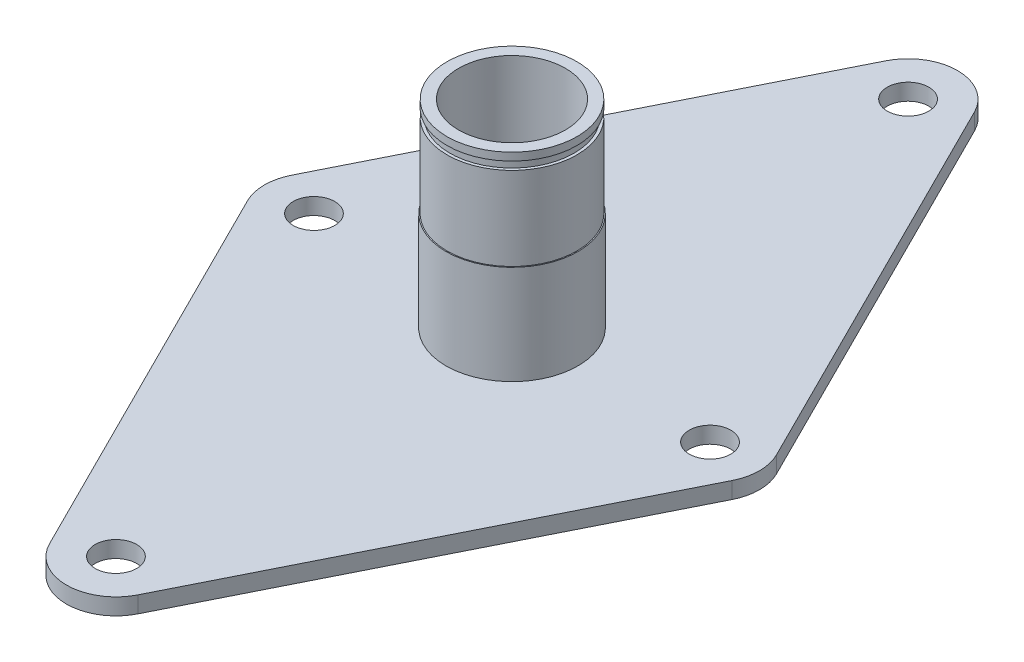
ISO-10303-21;
HEADER;
FILE_DESCRIPTION(('STEP AP214'),'2;1');
FILE_NAME('part.step','',(''),(''),'','','');
FILE_SCHEMA(('AUTOMOTIVE_DESIGN { 1 0 10303 214 1 1 1 1 }'));
ENDSEC;
DATA;
#1=APPLICATION_CONTEXT('core data for automotive mechanical design processes');
#2=APPLICATION_PROTOCOL_DEFINITION('international standard','automotive_design',2000,#1);
#3=PRODUCT_CONTEXT('',#1,'mechanical');
#4=PRODUCT('Part','Part','',(#3));
#5=PRODUCT_RELATED_PRODUCT_CATEGORY('part','',(#4));
#6=PRODUCT_DEFINITION_FORMATION('','',#4);
#7=PRODUCT_DEFINITION_CONTEXT('part definition',#1,'design');
#8=PRODUCT_DEFINITION('design','',#6,#7);
#9=PRODUCT_DEFINITION_SHAPE('','',#8);
#10=(LENGTH_UNIT() NAMED_UNIT(*) SI_UNIT(.MILLI.,.METRE.));
#11=(NAMED_UNIT(*) PLANE_ANGLE_UNIT() SI_UNIT($,.RADIAN.));
#12=(NAMED_UNIT(*) SI_UNIT($,.STERADIAN.) SOLID_ANGLE_UNIT());
#13=UNCERTAINTY_MEASURE_WITH_UNIT(LENGTH_MEASURE(1.E-05),#10,'distance_accuracy_value','');
#14=(GEOMETRIC_REPRESENTATION_CONTEXT(3) GLOBAL_UNCERTAINTY_ASSIGNED_CONTEXT((#13)) GLOBAL_UNIT_ASSIGNED_CONTEXT((#10,
#11,#12)) REPRESENTATION_CONTEXT('',''));
#15=CARTESIAN_POINT('',(0.,0.,0.));
#16=DIRECTION('',(0.,0.,1.));
#17=DIRECTION('',(1.,0.,0.));
#18=AXIS2_PLACEMENT_3D('',#15,#16,#17);
#19=CARTESIAN_POINT('',(0.,38.1,0.));
#20=DIRECTION('',(0.,-1.,0.));
#21=DIRECTION('',(0.,0.,-1.));
#22=AXIS2_PLACEMENT_3D('',#19,#20,#21);
#23=CYLINDRICAL_SURFACE('',#22,12.7);
#24=CARTESIAN_POINT('',(0.,0.,0.));
#25=DIRECTION('',(0.,1.,0.));
#26=DIRECTION('',(0.,0.,1.));
#27=AXIS2_PLACEMENT_3D('',#24,#25,#26);
#28=CIRCLE('',#27,12.7);
#29=CARTESIAN_POINT('',(0.,0.,12.7));
#30=VERTEX_POINT('',#29);
#31=EDGE_CURVE('E287',#30,#30,#28,.T.);
#32=ORIENTED_EDGE('',*,*,#31,.T.);
#33=EDGE_LOOP('',(#32));
#34=FACE_BOUND('',#33,.T.);
#35=CARTESIAN_POINT('',(0.,19.05,0.));
#36=DIRECTION('',(0.,1.,0.));
#37=DIRECTION('',(0.,0.,1.));
#38=AXIS2_PLACEMENT_3D('',#35,#36,#37);
#39=CIRCLE('',#38,12.7);
#40=CARTESIAN_POINT('',(0.,19.05,12.7));
#41=VERTEX_POINT('',#40);
#42=EDGE_CURVE('E281',#41,#41,#39,.T.);
#43=ORIENTED_EDGE('',*,*,#42,.F.);
#44=EDGE_LOOP('',(#43));
#45=FACE_BOUND('',#44,.T.);
#46=ADVANCED_FACE('F38',(#34,#45),#23,.T.);
#47=CARTESIAN_POINT('',(0.,-3.175,-76.2));
#48=DIRECTION('',(0.,1.,0.));
#49=DIRECTION('',(0.,0.,1.));
#50=AXIS2_PLACEMENT_3D('',#47,#48,#49);
#51=CYLINDRICAL_SURFACE('',#50,9.52500000000001);
#52=CARTESIAN_POINT('',(0.,0.,-76.2));
#53=DIRECTION('',(0.,1.,0.));
#54=DIRECTION('',(0.,0.,1.));
#55=AXIS2_PLACEMENT_3D('',#52,#53,#54);
#56=CIRCLE('',#55,9.52500000000001);
#57=CARTESIAN_POINT('',(8.51941899427421,0.,-80.4597094971371));
#58=VERTEX_POINT('',#57);
#59=CARTESIAN_POINT('',(-8.51941899427421,0.,-80.4597094971371));
#60=VERTEX_POINT('',#59);
#61=EDGE_CURVE('E137',#58,#60,#56,.T.);
#62=ORIENTED_EDGE('',*,*,#61,.F.);
#63=DIRECTION('',(0.,1.,0.));
#64=VECTOR('',#63,1.);
#65=CARTESIAN_POINT('',(8.51941899427421,-3.175,-80.4597094971371));
#66=LINE('',#65,#64);
#67=CARTESIAN_POINT('',(8.51941899427421,-3.175,-80.4597094971371));
#68=VERTEX_POINT('',#67);
#69=EDGE_CURVE('E47',#68,#58,#66,.T.);
#70=ORIENTED_EDGE('',*,*,#69,.F.);
#71=CARTESIAN_POINT('',(0.,-3.175,-76.2));
#72=DIRECTION('',(0.,1.,0.));
#73=DIRECTION('',(0.,0.,1.));
#74=AXIS2_PLACEMENT_3D('',#71,#72,#73);
#75=CIRCLE('',#74,9.52500000000001);
#76=CARTESIAN_POINT('',(-8.51941899427421,-3.175,-80.4597094971371));
#77=VERTEX_POINT('',#76);
#78=EDGE_CURVE('E159',#68,#77,#75,.T.);
#79=ORIENTED_EDGE('',*,*,#78,.T.);
#80=DIRECTION('',(0.,1.,0.));
#81=VECTOR('',#80,1.);
#82=CARTESIAN_POINT('',(-8.51941899427421,-3.175,-80.4597094971371));
#83=LINE('',#82,#81);
#84=EDGE_CURVE('E95',#77,#60,#83,.T.);
#85=ORIENTED_EDGE('',*,*,#84,.T.);
#86=EDGE_LOOP('',(#62,#70,#79,#85));
#87=FACE_BOUND('',#86,.T.);
#88=ADVANCED_FACE('F40',(#87),#51,.T.);
#89=CARTESIAN_POINT('',(46.6194189942742,-3.175,-4.2597094971371));
#90=DIRECTION('',(0.894427190999916,0.,-0.447213595499958));
#91=DIRECTION('',(-0.447213595499958,0.,-0.894427190999916));
#92=AXIS2_PLACEMENT_3D('',#89,#90,#91);
#93=PLANE('',#92);
#94=DIRECTION('',(-0.447213595499958,0.,-0.894427190999916));
#95=VECTOR('',#94,1.);
#96=CARTESIAN_POINT('',(46.6194189942742,0.,-4.2597094971371));
#97=LINE('',#96,#95);
#98=CARTESIAN_POINT('',(46.6194189942742,0.,-4.2597094971371));
#99=VERTEX_POINT('',#98);
#100=EDGE_CURVE('E156',#99,#58,#97,.T.);
#101=ORIENTED_EDGE('',*,*,#100,.F.);
#102=DIRECTION('',(0.,1.,0.));
#103=VECTOR('',#102,1.);
#104=CARTESIAN_POINT('',(46.6194189942742,-3.175,-4.2597094971371));
#105=LINE('',#104,#103);
#106=CARTESIAN_POINT('',(46.6194189942742,-3.175,-4.2597094971371));
#107=VERTEX_POINT('',#106);
#108=EDGE_CURVE('E83',#107,#99,#105,.T.);
#109=ORIENTED_EDGE('',*,*,#108,.F.);
#110=DIRECTION('',(-0.447213595499958,0.,-0.894427190999916));
#111=VECTOR('',#110,1.);
#112=CARTESIAN_POINT('',(46.6194189942742,-3.175,-4.2597094971371));
#113=LINE('',#112,#111);
#114=EDGE_CURVE('E127',#107,#68,#113,.T.);
#115=ORIENTED_EDGE('',*,*,#114,.T.);
#116=ORIENTED_EDGE('',*,*,#69,.T.);
#117=EDGE_LOOP('',(#101,#109,#115,#116));
#118=FACE_BOUND('',#117,.T.);
#119=ADVANCED_FACE('F172',(#118),#93,.T.);
#120=CARTESIAN_POINT('',(38.1,-3.175,0.));
#121=DIRECTION('',(0.,1.,0.));
#122=DIRECTION('',(0.,0.,1.));
#123=AXIS2_PLACEMENT_3D('',#120,#121,#122);
#124=CYLINDRICAL_SURFACE('',#123,9.525);
#125=CARTESIAN_POINT('',(38.1,0.,0.));
#126=DIRECTION('',(0.,1.,0.));
#127=DIRECTION('',(0.,0.,1.));
#128=AXIS2_PLACEMENT_3D('',#125,#126,#127);
#129=CIRCLE('',#128,9.525);
#130=CARTESIAN_POINT('',(46.6194189942742,0.,4.2597094971371));
#131=VERTEX_POINT('',#130);
#132=EDGE_CURVE('E114',#131,#99,#129,.T.);
#133=ORIENTED_EDGE('',*,*,#132,.F.);
#134=DIRECTION('',(0.,1.,0.));
#135=VECTOR('',#134,1.);
#136=CARTESIAN_POINT('',(46.6194189942742,-3.175,4.2597094971371));
#137=LINE('',#136,#135);
#138=CARTESIAN_POINT('',(46.6194189942742,-3.175,4.2597094971371));
#139=VERTEX_POINT('',#138);
#140=EDGE_CURVE('E109',#139,#131,#137,.T.);
#141=ORIENTED_EDGE('',*,*,#140,.F.);
#142=CARTESIAN_POINT('',(38.1,-3.175,0.));
#143=DIRECTION('',(0.,1.,0.));
#144=DIRECTION('',(0.,0.,1.));
#145=AXIS2_PLACEMENT_3D('',#142,#143,#144);
#146=CIRCLE('',#145,9.525);
#147=EDGE_CURVE('E112',#139,#107,#146,.T.);
#148=ORIENTED_EDGE('',*,*,#147,.T.);
#149=ORIENTED_EDGE('',*,*,#108,.T.);
#150=EDGE_LOOP('',(#133,#141,#148,#149));
#151=FACE_BOUND('',#150,.T.);
#152=ADVANCED_FACE('F111',(#151),#124,.T.);
#153=CARTESIAN_POINT('',(8.5194189942742,-3.175,80.4597094971371));
#154=DIRECTION('',(0.894427190999916,0.,0.447213595499958));
#155=DIRECTION('',(0.447213595499958,0.,-0.894427190999916));
#156=AXIS2_PLACEMENT_3D('',#153,#154,#155);
#157=PLANE('',#156);
#158=DIRECTION('',(0.447213595499958,0.,-0.894427190999916));
#159=VECTOR('',#158,1.);
#160=CARTESIAN_POINT('',(8.5194189942742,0.,80.4597094971371));
#161=LINE('',#160,#159);
#162=CARTESIAN_POINT('',(8.5194189942742,0.,80.4597094971371));
#163=VERTEX_POINT('',#162);
#164=EDGE_CURVE('E153',#163,#131,#161,.T.);
#165=ORIENTED_EDGE('',*,*,#164,.F.);
#166=DIRECTION('',(0.,1.,0.));
#167=VECTOR('',#166,1.);
#168=CARTESIAN_POINT('',(8.5194189942742,-3.175,80.4597094971371));
#169=LINE('',#168,#167);
#170=CARTESIAN_POINT('',(8.5194189942742,-3.175,80.4597094971371));
#171=VERTEX_POINT('',#170);
#172=EDGE_CURVE('E119',#171,#163,#169,.T.);
#173=ORIENTED_EDGE('',*,*,#172,.F.);
#174=DIRECTION('',(0.447213595499958,0.,-0.894427190999916));
#175=VECTOR('',#174,1.);
#176=CARTESIAN_POINT('',(8.5194189942742,-3.175,80.4597094971371));
#177=LINE('',#176,#175);
#178=EDGE_CURVE('E125',#171,#139,#177,.T.);
#179=ORIENTED_EDGE('',*,*,#178,.T.);
#180=ORIENTED_EDGE('',*,*,#140,.T.);
#181=EDGE_LOOP('',(#165,#173,#179,#180));
#182=FACE_BOUND('',#181,.T.);
#183=ADVANCED_FACE('F129',(#182),#157,.T.);
#184=CARTESIAN_POINT('',(0.,-3.175,76.2));
#185=DIRECTION('',(0.,1.,0.));
#186=DIRECTION('',(0.,0.,1.));
#187=AXIS2_PLACEMENT_3D('',#184,#185,#186);
#188=CYLINDRICAL_SURFACE('',#187,9.525);
#189=CARTESIAN_POINT('',(0.,0.,76.2));
#190=DIRECTION('',(0.,1.,0.));
#191=DIRECTION('',(0.,0.,1.));
#192=AXIS2_PLACEMENT_3D('',#189,#190,#191);
#193=CIRCLE('',#192,9.525);
#194=CARTESIAN_POINT('',(-8.5194189942742,0.,80.4597094971371));
#195=VERTEX_POINT('',#194);
#196=EDGE_CURVE('E150',#195,#163,#193,.T.);
#197=ORIENTED_EDGE('',*,*,#196,.F.);
#198=DIRECTION('',(0.,1.,0.));
#199=VECTOR('',#198,1.);
#200=CARTESIAN_POINT('',(-8.5194189942742,-3.175,80.4597094971371));
#201=LINE('',#200,#199);
#202=CARTESIAN_POINT('',(-8.5194189942742,-3.175,80.4597094971371));
#203=VERTEX_POINT('',#202);
#204=EDGE_CURVE('E163',#203,#195,#201,.T.);
#205=ORIENTED_EDGE('',*,*,#204,.F.);
#206=CARTESIAN_POINT('',(0.,-3.175,76.2));
#207=DIRECTION('',(0.,1.,0.));
#208=DIRECTION('',(0.,0.,1.));
#209=AXIS2_PLACEMENT_3D('',#206,#207,#208);
#210=CIRCLE('',#209,9.525);
#211=EDGE_CURVE('E130',#203,#171,#210,.T.);
#212=ORIENTED_EDGE('',*,*,#211,.T.);
#213=ORIENTED_EDGE('',*,*,#172,.T.);
#214=EDGE_LOOP('',(#197,#205,#212,#213));
#215=FACE_BOUND('',#214,.T.);
#216=ADVANCED_FACE('F327',(#215),#188,.T.);
#217=CARTESIAN_POINT('',(-46.6194189942742,-3.175,4.2597094971371));
#218=DIRECTION('',(-0.894427190999916,0.,0.447213595499958));
#219=DIRECTION('',(0.447213595499958,0.,0.894427190999916));
#220=AXIS2_PLACEMENT_3D('',#217,#218,#219);
#221=PLANE('',#220);
#222=DIRECTION('',(0.447213595499958,0.,0.894427190999916));
#223=VECTOR('',#222,1.);
#224=CARTESIAN_POINT('',(-46.6194189942742,0.,4.2597094971371));
#225=LINE('',#224,#223);
#226=CARTESIAN_POINT('',(-46.6194189942742,0.,4.2597094971371));
#227=VERTEX_POINT('',#226);
#228=EDGE_CURVE('E147',#227,#195,#225,.T.);
#229=ORIENTED_EDGE('',*,*,#228,.F.);
#230=DIRECTION('',(0.,1.,0.));
#231=VECTOR('',#230,1.);
#232=CARTESIAN_POINT('',(-46.6194189942742,-3.175,4.2597094971371));
#233=LINE('',#232,#231);
#234=CARTESIAN_POINT('',(-46.6194189942742,-3.175,4.2597094971371));
#235=VERTEX_POINT('',#234);
#236=EDGE_CURVE('E165',#235,#227,#233,.T.);
#237=ORIENTED_EDGE('',*,*,#236,.F.);
#238=DIRECTION('',(0.447213595499958,0.,0.894427190999916));
#239=VECTOR('',#238,1.);
#240=CARTESIAN_POINT('',(-46.6194189942742,-3.175,4.2597094971371));
#241=LINE('',#240,#239);
#242=EDGE_CURVE('E132',#235,#203,#241,.T.);
#243=ORIENTED_EDGE('',*,*,#242,.T.);
#244=ORIENTED_EDGE('',*,*,#204,.T.);
#245=EDGE_LOOP('',(#229,#237,#243,#244));
#246=FACE_BOUND('',#245,.T.);
#247=ADVANCED_FACE('F321',(#246),#221,.T.);
#248=CARTESIAN_POINT('',(-38.1,-3.175,0.));
#249=DIRECTION('',(0.,1.,0.));
#250=DIRECTION('',(0.,0.,1.));
#251=AXIS2_PLACEMENT_3D('',#248,#249,#250);
#252=CYLINDRICAL_SURFACE('',#251,9.525);
#253=CARTESIAN_POINT('',(-38.1,0.,0.));
#254=DIRECTION('',(0.,1.,0.));
#255=DIRECTION('',(0.,0.,1.));
#256=AXIS2_PLACEMENT_3D('',#253,#254,#255);
#257=CIRCLE('',#256,9.525);
#258=CARTESIAN_POINT('',(-46.6194189942742,0.,-4.2597094971371));
#259=VERTEX_POINT('',#258);
#260=EDGE_CURVE('E144',#259,#227,#257,.T.);
#261=ORIENTED_EDGE('',*,*,#260,.F.);
#262=DIRECTION('',(0.,1.,0.));
#263=VECTOR('',#262,1.);
#264=CARTESIAN_POINT('',(-46.6194189942742,-3.175,-4.2597094971371));
#265=LINE('',#264,#263);
#266=CARTESIAN_POINT('',(-46.6194189942742,-3.175,-4.2597094971371));
#267=VERTEX_POINT('',#266);
#268=EDGE_CURVE('E167',#267,#259,#265,.T.);
#269=ORIENTED_EDGE('',*,*,#268,.F.);
#270=CARTESIAN_POINT('',(-38.1,-3.175,0.));
#271=DIRECTION('',(0.,1.,0.));
#272=DIRECTION('',(0.,0.,1.));
#273=AXIS2_PLACEMENT_3D('',#270,#271,#272);
#274=CIRCLE('',#273,9.525);
#275=EDGE_CURVE('E315',#267,#235,#274,.T.);
#276=ORIENTED_EDGE('',*,*,#275,.T.);
#277=ORIENTED_EDGE('',*,*,#236,.T.);
#278=EDGE_LOOP('',(#261,#269,#276,#277));
#279=FACE_BOUND('',#278,.T.);
#280=ADVANCED_FACE('F325',(#279),#252,.T.);
#281=CARTESIAN_POINT('',(-8.51941899427421,-3.175,-80.4597094971371));
#282=DIRECTION('',(-0.894427190999916,0.,-0.447213595499958));
#283=DIRECTION('',(-0.447213595499958,0.,0.894427190999916));
#284=AXIS2_PLACEMENT_3D('',#281,#282,#283);
#285=PLANE('',#284);
#286=DIRECTION('',(-0.447213595499958,0.,0.894427190999916));
#287=VECTOR('',#286,1.);
#288=CARTESIAN_POINT('',(-8.51941899427421,0.,-80.4597094971371));
#289=LINE('',#288,#287);
#290=EDGE_CURVE('E140',#60,#259,#289,.T.);
#291=ORIENTED_EDGE('',*,*,#290,.F.);
#292=ORIENTED_EDGE('',*,*,#84,.F.);
#293=DIRECTION('',(-0.447213595499958,0.,0.894427190999916));
#294=VECTOR('',#293,1.);
#295=CARTESIAN_POINT('',(-8.51941899427421,-3.175,-80.4597094971371));
#296=LINE('',#295,#294);
#297=EDGE_CURVE('E313',#77,#267,#296,.T.);
#298=ORIENTED_EDGE('',*,*,#297,.T.);
#299=ORIENTED_EDGE('',*,*,#268,.T.);
#300=EDGE_LOOP('',(#291,#292,#298,#299));
#301=FACE_BOUND('',#300,.T.);
#302=ADVANCED_FACE('F168',(#301),#285,.T.);
#303=CARTESIAN_POINT('',(0.,-3.175,-76.2));
#304=DIRECTION('',(0.,1.,0.));
#305=DIRECTION('',(0.,0.,1.));
#306=AXIS2_PLACEMENT_3D('',#303,#304,#305);
#307=PLANE('',#306);
#308=CARTESIAN_POINT('',(38.1,-3.175,0.));
#309=DIRECTION('',(0.,1.,0.));
#310=DIRECTION('',(0.,0.,1.));
#311=AXIS2_PLACEMENT_3D('',#308,#309,#310);
#312=CIRCLE('',#311,4.);
#313=CARTESIAN_POINT('',(38.1,-3.175,4.));
#314=VERTEX_POINT('',#313);
#315=EDGE_CURVE('E290',#314,#314,#312,.T.);
#316=ORIENTED_EDGE('',*,*,#315,.T.);
#317=EDGE_LOOP('',(#316));
#318=FACE_BOUND('',#317,.T.);
#319=CARTESIAN_POINT('',(-38.1,-3.175,0.));
#320=DIRECTION('',(0.,1.,0.));
#321=DIRECTION('',(0.,0.,1.));
#322=AXIS2_PLACEMENT_3D('',#319,#320,#321);
#323=CIRCLE('',#322,4.00000000000001);
#324=CARTESIAN_POINT('',(-38.1,-3.175,4.00000000000001));
#325=VERTEX_POINT('',#324);
#326=EDGE_CURVE('E296',#325,#325,#323,.T.);
#327=ORIENTED_EDGE('',*,*,#326,.T.);
#328=EDGE_LOOP('',(#327));
#329=FACE_BOUND('',#328,.T.);
#330=CARTESIAN_POINT('',(0.,-3.175,76.2));
#331=DIRECTION('',(0.,1.,0.));
#332=DIRECTION('',(0.,0.,1.));
#333=AXIS2_PLACEMENT_3D('',#330,#331,#332);
#334=CIRCLE('',#333,4.);
#335=CARTESIAN_POINT('',(0.,-3.175,80.2));
#336=VERTEX_POINT('',#335);
#337=EDGE_CURVE('E302',#336,#336,#334,.T.);
#338=ORIENTED_EDGE('',*,*,#337,.T.);
#339=EDGE_LOOP('',(#338));
#340=FACE_BOUND('',#339,.T.);
#341=CARTESIAN_POINT('',(0.,-3.175,-76.2));
#342=DIRECTION('',(0.,1.,0.));
#343=DIRECTION('',(0.,0.,1.));
#344=AXIS2_PLACEMENT_3D('',#341,#342,#343);
#345=CIRCLE('',#344,4.);
#346=CARTESIAN_POINT('',(0.,-3.175,-72.2));
#347=VERTEX_POINT('',#346);
#348=EDGE_CURVE('E141',#347,#347,#345,.T.);
#349=ORIENTED_EDGE('',*,*,#348,.T.);
#350=EDGE_LOOP('',(#349));
#351=FACE_BOUND('',#350,.T.);
#352=ORIENTED_EDGE('',*,*,#78,.F.);
#353=ORIENTED_EDGE('',*,*,#114,.F.);
#354=ORIENTED_EDGE('',*,*,#147,.F.);
#355=ORIENTED_EDGE('',*,*,#178,.F.);
#356=ORIENTED_EDGE('',*,*,#211,.F.);
#357=ORIENTED_EDGE('',*,*,#242,.F.);
#358=ORIENTED_EDGE('',*,*,#275,.F.);
#359=ORIENTED_EDGE('',*,*,#297,.F.);
#360=EDGE_LOOP('',(#352,#353,#354,#355,#356,#357,#358,#359));
#361=FACE_BOUND('',#360,.T.);
#362=ADVANCED_FACE('F123',(#318,#329,#340,#351,#361),#307,.F.);
#363=CARTESIAN_POINT('',(0.,0.,-76.2));
#364=DIRECTION('',(0.,1.,0.));
#365=DIRECTION('',(0.,0.,1.));
#366=AXIS2_PLACEMENT_3D('',#363,#364,#365);
#367=PLANE('',#366);
#368=ORIENTED_EDGE('',*,*,#31,.F.);
#369=EDGE_LOOP('',(#368));
#370=FACE_BOUND('',#369,.T.);
#371=CARTESIAN_POINT('',(38.1,0.,0.));
#372=DIRECTION('',(0.,1.,0.));
#373=DIRECTION('',(0.,0.,1.));
#374=AXIS2_PLACEMENT_3D('',#371,#372,#373);
#375=CIRCLE('',#374,4.);
#376=CARTESIAN_POINT('',(38.1,0.,4.));
#377=VERTEX_POINT('',#376);
#378=EDGE_CURVE('E289',#377,#377,#375,.T.);
#379=ORIENTED_EDGE('',*,*,#378,.F.);
#380=EDGE_LOOP('',(#379));
#381=FACE_BOUND('',#380,.T.);
#382=CARTESIAN_POINT('',(-38.1,0.,0.));
#383=DIRECTION('',(0.,1.,0.));
#384=DIRECTION('',(0.,0.,1.));
#385=AXIS2_PLACEMENT_3D('',#382,#383,#384);
#386=CIRCLE('',#385,4.00000000000001);
#387=CARTESIAN_POINT('',(-38.1,0.,4.00000000000001));
#388=VERTEX_POINT('',#387);
#389=EDGE_CURVE('E293',#388,#388,#386,.T.);
#390=ORIENTED_EDGE('',*,*,#389,.F.);
#391=EDGE_LOOP('',(#390));
#392=FACE_BOUND('',#391,.T.);
#393=CARTESIAN_POINT('',(0.,0.,76.2));
#394=DIRECTION('',(0.,1.,0.));
#395=DIRECTION('',(0.,0.,1.));
#396=AXIS2_PLACEMENT_3D('',#393,#394,#395);
#397=CIRCLE('',#396,4.);
#398=CARTESIAN_POINT('',(0.,0.,80.2));
#399=VERTEX_POINT('',#398);
#400=EDGE_CURVE('E299',#399,#399,#397,.T.);
#401=ORIENTED_EDGE('',*,*,#400,.F.);
#402=EDGE_LOOP('',(#401));
#403=FACE_BOUND('',#402,.T.);
#404=CARTESIAN_POINT('',(0.,0.,-76.2));
#405=DIRECTION('',(0.,1.,0.));
#406=DIRECTION('',(0.,0.,1.));
#407=AXIS2_PLACEMENT_3D('',#404,#405,#406);
#408=CIRCLE('',#407,4.);
#409=CARTESIAN_POINT('',(0.,0.,-72.2));
#410=VERTEX_POINT('',#409);
#411=EDGE_CURVE('E305',#410,#410,#408,.T.);
#412=ORIENTED_EDGE('',*,*,#411,.F.);
#413=EDGE_LOOP('',(#412));
#414=FACE_BOUND('',#413,.T.);
#415=ORIENTED_EDGE('',*,*,#61,.T.);
#416=ORIENTED_EDGE('',*,*,#290,.T.);
#417=ORIENTED_EDGE('',*,*,#260,.T.);
#418=ORIENTED_EDGE('',*,*,#228,.T.);
#419=ORIENTED_EDGE('',*,*,#196,.T.);
#420=ORIENTED_EDGE('',*,*,#164,.T.);
#421=ORIENTED_EDGE('',*,*,#132,.T.);
#422=ORIENTED_EDGE('',*,*,#100,.T.);
#423=EDGE_LOOP('',(#415,#416,#417,#418,#419,#420,#421,#422));
#424=FACE_BOUND('',#423,.T.);
#425=ADVANCED_FACE('F171',(#370,#381,#392,#403,#414,#424),#367,.T.);
#426=CARTESIAN_POINT('',(0.,-3.175,-76.2));
#427=DIRECTION('',(0.,1.,0.));
#428=DIRECTION('',(0.,0.,1.));
#429=AXIS2_PLACEMENT_3D('',#426,#427,#428);
#430=CYLINDRICAL_SURFACE('',#429,4.);
#431=ORIENTED_EDGE('',*,*,#348,.F.);
#432=EDGE_LOOP('',(#431));
#433=FACE_BOUND('',#432,.T.);
#434=ORIENTED_EDGE('',*,*,#411,.T.);
#435=EDGE_LOOP('',(#434));
#436=FACE_BOUND('',#435,.T.);
#437=ADVANCED_FACE('F204',(#433,#436),#430,.F.);
#438=CARTESIAN_POINT('',(0.,-3.175,76.2));
#439=DIRECTION('',(0.,1.,0.));
#440=DIRECTION('',(0.,0.,1.));
#441=AXIS2_PLACEMENT_3D('',#438,#439,#440);
#442=CYLINDRICAL_SURFACE('',#441,4.);
#443=ORIENTED_EDGE('',*,*,#337,.F.);
#444=EDGE_LOOP('',(#443));
#445=FACE_BOUND('',#444,.T.);
#446=ORIENTED_EDGE('',*,*,#400,.T.);
#447=EDGE_LOOP('',(#446));
#448=FACE_BOUND('',#447,.T.);
#449=ADVANCED_FACE('F200',(#445,#448),#442,.F.);
#450=CARTESIAN_POINT('',(-38.1,-3.175,0.));
#451=DIRECTION('',(0.,1.,0.));
#452=DIRECTION('',(0.,0.,1.));
#453=AXIS2_PLACEMENT_3D('',#450,#451,#452);
#454=CYLINDRICAL_SURFACE('',#453,4.00000000000001);
#455=ORIENTED_EDGE('',*,*,#326,.F.);
#456=EDGE_LOOP('',(#455));
#457=FACE_BOUND('',#456,.T.);
#458=ORIENTED_EDGE('',*,*,#389,.T.);
#459=EDGE_LOOP('',(#458));
#460=FACE_BOUND('',#459,.T.);
#461=ADVANCED_FACE('F196',(#457,#460),#454,.F.);
#462=CARTESIAN_POINT('',(38.1,-3.175,0.));
#463=DIRECTION('',(0.,1.,0.));
#464=DIRECTION('',(0.,0.,1.));
#465=AXIS2_PLACEMENT_3D('',#462,#463,#464);
#466=CYLINDRICAL_SURFACE('',#465,4.);
#467=ORIENTED_EDGE('',*,*,#315,.F.);
#468=EDGE_LOOP('',(#467));
#469=FACE_BOUND('',#468,.T.);
#470=ORIENTED_EDGE('',*,*,#378,.T.);
#471=EDGE_LOOP('',(#470));
#472=FACE_BOUND('',#471,.T.);
#473=ADVANCED_FACE('F192',(#469,#472),#466,.F.);
#474=CARTESIAN_POINT('',(0.,19.05,0.));
#475=DIRECTION('',(0.,1.,0.));
#476=DIRECTION('',(0.,0.,1.));
#477=AXIS2_PLACEMENT_3D('',#474,#475,#476);
#478=CYLINDRICAL_SURFACE('',#477,12.5);
#479=CARTESIAN_POINT('',(2.16820990276271E-13,35.063199876,0.));
#480=DIRECTION('',(0.,-1.,0.));
#481=DIRECTION('',(1.,0.,0.));
#482=AXIS2_PLACEMENT_3D('',#479,#480,#481);
#483=CIRCLE('',#482,12.5);
#484=CARTESIAN_POINT('',(12.5000000000002,35.0631998759999,0.));
#485=VERTEX_POINT('',#484);
#486=EDGE_CURVE('E269',#485,#485,#483,.T.);
#487=ORIENTED_EDGE('',*,*,#486,.T.);
#488=EDGE_LOOP('',(#487));
#489=FACE_BOUND('',#488,.T.);
#490=CARTESIAN_POINT('',(0.,19.05,0.));
#491=DIRECTION('',(0.,1.,0.));
#492=DIRECTION('',(0.,0.,1.));
#493=AXIS2_PLACEMENT_3D('',#490,#491,#492);
#494=CIRCLE('',#493,12.5);
#495=CARTESIAN_POINT('',(0.,19.05,12.5));
#496=VERTEX_POINT('',#495);
#497=EDGE_CURVE('E271',#496,#496,#494,.T.);
#498=ORIENTED_EDGE('',*,*,#497,.T.);
#499=EDGE_LOOP('',(#498));
#500=FACE_BOUND('',#499,.T.);
#501=ADVANCED_FACE('F195',(#489,#500),#478,.T.);
#502=CARTESIAN_POINT('',(0.,19.05,0.));
#503=DIRECTION('',(0.,1.,0.));
#504=DIRECTION('',(0.,0.,1.));
#505=AXIS2_PLACEMENT_3D('',#502,#503,#504);
#506=PLANE('',#505);
#507=ORIENTED_EDGE('',*,*,#497,.F.);
#508=EDGE_LOOP('',(#507));
#509=FACE_BOUND('',#508,.T.);
#510=ORIENTED_EDGE('',*,*,#42,.T.);
#511=EDGE_LOOP('',(#510));
#512=FACE_BOUND('',#511,.T.);
#513=ADVANCED_FACE('F242',(#509,#512),#506,.T.);
#514=CARTESIAN_POINT('',(2.27644582426685E-13,36.613199876,0.));
#515=DIRECTION('',(0.,-1.,0.));
#516=DIRECTION('',(1.,0.,0.));
#517=AXIS2_PLACEMENT_3D('',#514,#515,#516);
#518=PLANE('',#517);
#519=CARTESIAN_POINT('',(2.27644582426685E-13,36.613199876,0.));
#520=DIRECTION('',(0.,-1.,0.));
#521=DIRECTION('',(1.,0.,0.));
#522=AXIS2_PLACEMENT_3D('',#519,#520,#521);
#523=CIRCLE('',#522,11.95);
#524=CARTESIAN_POINT('',(11.9500000000002,36.6131998759999,0.));
#525=VERTEX_POINT('',#524);
#526=EDGE_CURVE('E273',#525,#525,#523,.T.);
#527=ORIENTED_EDGE('',*,*,#526,.F.);
#528=EDGE_LOOP('',(#527));
#529=FACE_BOUND('',#528,.T.);
#530=CARTESIAN_POINT('',(2.27644582426685E-13,36.613199876,0.));
#531=DIRECTION('',(0.,-1.,0.));
#532=DIRECTION('',(1.,0.,0.));
#533=AXIS2_PLACEMENT_3D('',#530,#531,#532);
#534=CIRCLE('',#533,12.5);
#535=CARTESIAN_POINT('',(12.5000000000002,36.6131998759999,0.));
#536=VERTEX_POINT('',#535);
#537=EDGE_CURVE('E267',#536,#536,#534,.T.);
#538=ORIENTED_EDGE('',*,*,#537,.T.);
#539=EDGE_LOOP('',(#538));
#540=FACE_BOUND('',#539,.T.);
#541=ADVANCED_FACE('F235',(#529,#540),#518,.T.);
#542=CARTESIAN_POINT('',(2.16820990276271E-13,35.063199876,0.));
#543=DIRECTION('',(0.,-1.,0.));
#544=DIRECTION('',(1.,0.,0.));
#545=AXIS2_PLACEMENT_3D('',#542,#543,#544);
#546=PLANE('',#545);
#547=CARTESIAN_POINT('',(2.16820990276271E-13,35.063199876,0.));
#548=DIRECTION('',(0.,-1.,0.));
#549=DIRECTION('',(1.,0.,0.));
#550=AXIS2_PLACEMENT_3D('',#547,#548,#549);
#551=CIRCLE('',#550,11.95);
#552=CARTESIAN_POINT('',(11.9500000000002,35.0631998759999,0.));
#553=VERTEX_POINT('',#552);
#554=EDGE_CURVE('E276',#553,#553,#551,.T.);
#555=ORIENTED_EDGE('',*,*,#554,.T.);
#556=EDGE_LOOP('',(#555));
#557=FACE_BOUND('',#556,.T.);
#558=ORIENTED_EDGE('',*,*,#486,.F.);
#559=EDGE_LOOP('',(#558));
#560=FACE_BOUND('',#559,.T.);
#561=ADVANCED_FACE('F227',(#557,#560),#546,.F.);
#562=CARTESIAN_POINT('',(2.27644582426685E-13,36.613199876,0.));
#563=DIRECTION('',(0.,-1.,0.));
#564=DIRECTION('',(1.,0.,0.));
#565=AXIS2_PLACEMENT_3D('',#562,#563,#564);
#566=CYLINDRICAL_SURFACE('',#565,11.95);
#567=ORIENTED_EDGE('',*,*,#526,.T.);
#568=EDGE_LOOP('',(#567));
#569=FACE_BOUND('',#568,.T.);
#570=ORIENTED_EDGE('',*,*,#554,.F.);
#571=EDGE_LOOP('',(#570));
#572=FACE_BOUND('',#571,.T.);
#573=ADVANCED_FACE('F220',(#569,#572),#566,.T.);
#574=CARTESIAN_POINT('',(0.,0.,0.));
#575=DIRECTION('',(0.,1.,0.));
#576=DIRECTION('',(0.,0.,1.));
#577=AXIS2_PLACEMENT_3D('',#574,#575,#576);
#578=CIRCLE('',#577,10.287);
#579=CARTESIAN_POINT('',(0.,0.,10.287));
#580=VERTEX_POINT('',#579);
#581=EDGE_CURVE('E12',#580,#580,#578,.F.);
#582=ORIENTED_EDGE('',*,*,#581,.F.);
#583=EDGE_LOOP('',(#582));
#584=FACE_BOUND('',#583,.T.);
#585=ADVANCED_FACE('F213',(#584),#367,.T.);
#586=CARTESIAN_POINT('',(0.,38.1,0.));
#587=DIRECTION('',(0.,-1.,0.));
#588=DIRECTION('',(0.,0.,-1.));
#589=AXIS2_PLACEMENT_3D('',#586,#587,#588);
#590=CYLINDRICAL_SURFACE('',#589,10.287);
#591=CARTESIAN_POINT('',(0.,38.1,0.));
#592=DIRECTION('',(0.,1.,0.));
#593=DIRECTION('',(1.,0.,0.));
#594=AXIS2_PLACEMENT_3D('',#591,#592,#593);
#595=CIRCLE('',#594,10.287);
#596=CARTESIAN_POINT('',(10.287,38.1,0.));
#597=VERTEX_POINT('',#596);
#598=EDGE_CURVE('E283',#597,#597,#595,.T.);
#599=ORIENTED_EDGE('',*,*,#598,.T.);
#600=EDGE_LOOP('',(#599));
#601=FACE_BOUND('',#600,.T.);
#602=ORIENTED_EDGE('',*,*,#581,.T.);
#603=EDGE_LOOP('',(#602));
#604=FACE_BOUND('',#603,.T.);
#605=ADVANCED_FACE('F219',(#601,#604),#590,.F.);
#606=CARTESIAN_POINT('',(0.,38.1,0.));
#607=DIRECTION('',(0.,1.,0.));
#608=DIRECTION('',(0.,0.,1.));
#609=AXIS2_PLACEMENT_3D('',#606,#607,#608);
#610=PLANE('',#609);
#611=ORIENTED_EDGE('',*,*,#598,.F.);
#612=EDGE_LOOP('',(#611));
#613=FACE_BOUND('',#612,.T.);
#614=CARTESIAN_POINT('',(0.,38.1,0.));
#615=DIRECTION('',(0.,1.,0.));
#616=DIRECTION('',(0.,0.,1.));
#617=AXIS2_PLACEMENT_3D('',#614,#615,#616);
#618=CIRCLE('',#617,12.5);
#619=CARTESIAN_POINT('',(0.,38.1,12.5));
#620=VERTEX_POINT('',#619);
#621=EDGE_CURVE('E264',#620,#620,#618,.T.);
#622=ORIENTED_EDGE('',*,*,#621,.T.);
#623=EDGE_LOOP('',(#622));
#624=FACE_BOUND('',#623,.T.);
#625=ADVANCED_FACE('F190',(#613,#624),#610,.T.);
#626=ORIENTED_EDGE('',*,*,#621,.F.);
#627=EDGE_LOOP('',(#626));
#628=FACE_BOUND('',#627,.T.);
#629=ORIENTED_EDGE('',*,*,#537,.F.);
#630=EDGE_LOOP('',(#629));
#631=FACE_BOUND('',#630,.T.);
#632=ADVANCED_FACE('F250',(#628,#631),#478,.T.);
#633=CLOSED_SHELL('',(#46,#88,#119,#152,#183,#216,#247,#280,#302,#362,#425,#437,#449,#461,#473,
#501,#513,#541,#561,#573,#585,#605,#625,#632));
#634=MANIFOLD_SOLID_BREP('B2',#633);
#635=ADVANCED_BREP_SHAPE_REPRESENTATION('',(#18,#634),#14);
#636=SHAPE_DEFINITION_REPRESENTATION(#9,#635);
ENDSEC;
END-ISO-10303-21;
